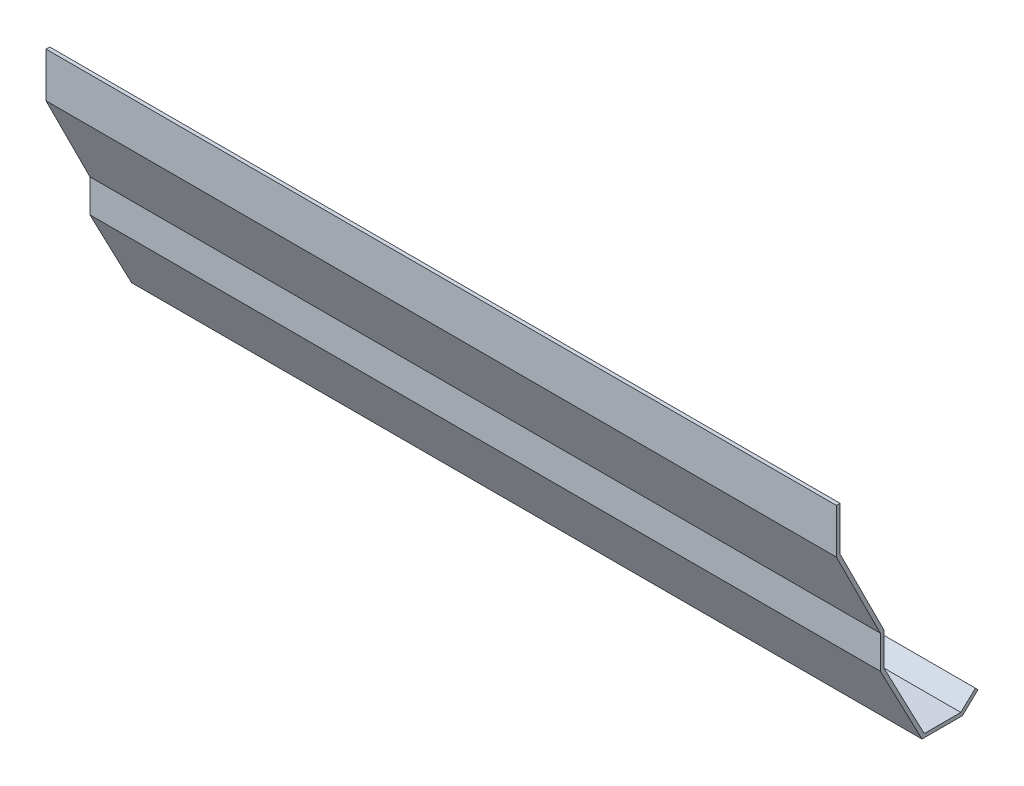
ISO-10303-21;
HEADER;
FILE_DESCRIPTION(('STEP AP214'),'2;1');
FILE_NAME('part.step','',(''),(''),'','','');
FILE_SCHEMA(('AUTOMOTIVE_DESIGN { 1 0 10303 214 1 1 1 1 }'));
ENDSEC;
DATA;
#1=APPLICATION_CONTEXT('core data for automotive mechanical design processes');
#2=APPLICATION_PROTOCOL_DEFINITION('international standard','automotive_design',2000,#1);
#3=PRODUCT_CONTEXT('',#1,'mechanical');
#4=PRODUCT('Part','Part','',(#3));
#5=PRODUCT_RELATED_PRODUCT_CATEGORY('part','',(#4));
#6=PRODUCT_DEFINITION_FORMATION('','',#4);
#7=PRODUCT_DEFINITION_CONTEXT('part definition',#1,'design');
#8=PRODUCT_DEFINITION('design','',#6,#7);
#9=PRODUCT_DEFINITION_SHAPE('','',#8);
#10=(LENGTH_UNIT() NAMED_UNIT(*) SI_UNIT(.MILLI.,.METRE.));
#11=(NAMED_UNIT(*) PLANE_ANGLE_UNIT() SI_UNIT($,.RADIAN.));
#12=(NAMED_UNIT(*) SI_UNIT($,.STERADIAN.) SOLID_ANGLE_UNIT());
#13=UNCERTAINTY_MEASURE_WITH_UNIT(LENGTH_MEASURE(1.E-05),#10,'distance_accuracy_value','');
#14=(GEOMETRIC_REPRESENTATION_CONTEXT(3) GLOBAL_UNCERTAINTY_ASSIGNED_CONTEXT((#13)) GLOBAL_UNIT_ASSIGNED_CONTEXT((#10,
#11,#12)) REPRESENTATION_CONTEXT('',''));
#15=CARTESIAN_POINT('',(0.,0.,0.));
#16=DIRECTION('',(0.,0.,1.));
#17=DIRECTION('',(1.,0.,0.));
#18=AXIS2_PLACEMENT_3D('',#15,#16,#17);
#19=CARTESIAN_POINT('',(685.8,0.,0.));
#20=DIRECTION('',(0.,-0.447213595499958,0.894427190999916));
#21=DIRECTION('',(0.,-0.894427190999916,-0.447213595499958));
#22=AXIS2_PLACEMENT_3D('',#19,#20,#21);
#23=PLANE('',#22);
#24=DIRECTION('',(0.,0.894427190999916,0.447213595499958));
#25=VECTOR('',#24,1.);
#26=CARTESIAN_POINT('',(0.,0.,0.));
#27=LINE('',#26,#25);
#28=CARTESIAN_POINT('',(0.,0.,0.));
#29=VERTEX_POINT('',#28);
#30=CARTESIAN_POINT('',(0.,76.2,38.1));
#31=VERTEX_POINT('',#30);
#32=EDGE_CURVE('E167',#29,#31,#27,.T.);
#33=ORIENTED_EDGE('',*,*,#32,.T.);
#34=DIRECTION('',(-1.,0.,0.));
#35=VECTOR('',#34,1.);
#36=CARTESIAN_POINT('',(685.8,76.2,38.1));
#37=LINE('',#36,#35);
#38=CARTESIAN_POINT('',(685.8,76.2,38.1));
#39=VERTEX_POINT('',#38);
#40=EDGE_CURVE('E11',#39,#31,#37,.T.);
#41=ORIENTED_EDGE('',*,*,#40,.F.);
#42=DIRECTION('',(0.,0.894427190999916,0.447213595499958));
#43=VECTOR('',#42,1.);
#44=CARTESIAN_POINT('',(685.8,0.,0.));
#45=LINE('',#44,#43);
#46=CARTESIAN_POINT('',(685.8,0.,0.));
#47=VERTEX_POINT('',#46);
#48=EDGE_CURVE('E193',#47,#39,#45,.T.);
#49=ORIENTED_EDGE('',*,*,#48,.F.);
#50=DIRECTION('',(-1.,0.,0.));
#51=VECTOR('',#50,1.);
#52=CARTESIAN_POINT('',(685.8,0.,0.));
#53=LINE('',#52,#51);
#54=EDGE_CURVE('E163',#47,#29,#53,.T.);
#55=ORIENTED_EDGE('',*,*,#54,.T.);
#56=EDGE_LOOP('',(#33,#41,#49,#55));
#57=FACE_BOUND('',#56,.T.);
#58=ADVANCED_FACE('F35',(#57),#23,.F.);
#59=CARTESIAN_POINT('',(685.8,76.2,38.1));
#60=DIRECTION('',(0.,0.,1.));
#61=DIRECTION('',(1.,0.,0.));
#62=AXIS2_PLACEMENT_3D('',#59,#60,#61);
#63=PLANE('',#62);
#64=DIRECTION('',(0.,1.,0.));
#65=VECTOR('',#64,1.);
#66=CARTESIAN_POINT('',(0.,76.2,38.1));
#67=LINE('',#66,#65);
#68=CARTESIAN_POINT('',(0.,114.3,38.1));
#69=VERTEX_POINT('',#68);
#70=EDGE_CURVE('E170',#31,#69,#67,.T.);
#71=ORIENTED_EDGE('',*,*,#70,.T.);
#72=DIRECTION('',(-1.,0.,0.));
#73=VECTOR('',#72,1.);
#74=CARTESIAN_POINT('',(685.8,114.3,38.1));
#75=LINE('',#74,#73);
#76=CARTESIAN_POINT('',(685.8,114.3,38.1));
#77=VERTEX_POINT('',#76);
#78=EDGE_CURVE('E43',#77,#69,#75,.T.);
#79=ORIENTED_EDGE('',*,*,#78,.F.);
#80=DIRECTION('',(0.,1.,0.));
#81=VECTOR('',#80,1.);
#82=CARTESIAN_POINT('',(685.8,76.2,38.1));
#83=LINE('',#82,#81);
#84=EDGE_CURVE('E112',#39,#77,#83,.T.);
#85=ORIENTED_EDGE('',*,*,#84,.F.);
#86=ORIENTED_EDGE('',*,*,#40,.T.);
#87=EDGE_LOOP('',(#71,#79,#85,#86));
#88=FACE_BOUND('',#87,.T.);
#89=ADVANCED_FACE('F281',(#88),#63,.F.);
#90=CARTESIAN_POINT('',(685.8,114.3,38.1));
#91=DIRECTION('',(0.,-1.,0.));
#92=DIRECTION('',(0.,0.,-1.));
#93=AXIS2_PLACEMENT_3D('',#90,#91,#92);
#94=PLANE('',#93);
#95=DIRECTION('',(0.,0.,1.));
#96=VECTOR('',#95,1.);
#97=CARTESIAN_POINT('',(0.,114.3,38.1));
#98=LINE('',#97,#96);
#99=CARTESIAN_POINT('',(0.,114.3,41.275));
#100=VERTEX_POINT('',#99);
#101=EDGE_CURVE('E172',#69,#100,#98,.T.);
#102=ORIENTED_EDGE('',*,*,#101,.T.);
#103=DIRECTION('',(-1.,0.,0.));
#104=VECTOR('',#103,1.);
#105=CARTESIAN_POINT('',(685.8,114.3,41.275));
#106=LINE('',#105,#104);
#107=CARTESIAN_POINT('',(685.8,114.3,41.275));
#108=VERTEX_POINT('',#107);
#109=EDGE_CURVE('E218',#108,#100,#106,.T.);
#110=ORIENTED_EDGE('',*,*,#109,.F.);
#111=DIRECTION('',(0.,0.,1.));
#112=VECTOR('',#111,1.);
#113=CARTESIAN_POINT('',(685.8,114.3,38.1));
#114=LINE('',#113,#112);
#115=EDGE_CURVE('E226',#77,#108,#114,.T.);
#116=ORIENTED_EDGE('',*,*,#115,.F.);
#117=ORIENTED_EDGE('',*,*,#78,.T.);
#118=EDGE_LOOP('',(#102,#110,#116,#117));
#119=FACE_BOUND('',#118,.T.);
#120=ADVANCED_FACE('F224',(#119),#94,.F.);
#121=CARTESIAN_POINT('',(685.8,114.3,41.275));
#122=DIRECTION('',(0.,0.,-1.));
#123=DIRECTION('',(-1.,0.,0.));
#124=AXIS2_PLACEMENT_3D('',#121,#122,#123);
#125=PLANE('',#124);
#126=DIRECTION('',(0.,-1.,0.));
#127=VECTOR('',#126,1.);
#128=CARTESIAN_POINT('',(0.,114.3,41.275));
#129=LINE('',#128,#127);
#130=CARTESIAN_POINT('',(0.,75.4504841714382,41.275));
#131=VERTEX_POINT('',#130);
#132=EDGE_CURVE('E174',#100,#131,#129,.T.);
#133=ORIENTED_EDGE('',*,*,#132,.T.);
#134=DIRECTION('',(-1.,0.,0.));
#135=VECTOR('',#134,1.);
#136=CARTESIAN_POINT('',(685.8,75.4504841714382,41.275));
#137=LINE('',#136,#135);
#138=CARTESIAN_POINT('',(685.8,75.4504841714382,41.275));
#139=VERTEX_POINT('',#138);
#140=EDGE_CURVE('E215',#139,#131,#137,.T.);
#141=ORIENTED_EDGE('',*,*,#140,.F.);
#142=DIRECTION('',(0.,-1.,0.));
#143=VECTOR('',#142,1.);
#144=CARTESIAN_POINT('',(685.8,114.3,41.275));
#145=LINE('',#144,#143);
#146=EDGE_CURVE('E244',#108,#139,#145,.T.);
#147=ORIENTED_EDGE('',*,*,#146,.F.);
#148=ORIENTED_EDGE('',*,*,#109,.T.);
#149=EDGE_LOOP('',(#133,#141,#147,#148));
#150=FACE_BOUND('',#149,.T.);
#151=ADVANCED_FACE('F235',(#150),#125,.F.);
#152=CARTESIAN_POINT('',(685.8,75.4504841714382,41.275));
#153=DIRECTION('',(0.,0.447213595499958,-0.894427190999916));
#154=DIRECTION('',(0.,0.894427190999916,0.447213595499958));
#155=AXIS2_PLACEMENT_3D('',#152,#153,#154);
#156=PLANE('',#155);
#157=DIRECTION('',(0.,-0.894427190999916,-0.447213595499958));
#158=VECTOR('',#157,1.);
#159=CARTESIAN_POINT('',(0.,75.4504841714382,41.275));
#160=LINE('',#159,#158);
#161=CARTESIAN_POINT('',(0.,-0.749515828561824,3.17499999999998));
#162=VERTEX_POINT('',#161);
#163=EDGE_CURVE('E176',#131,#162,#160,.T.);
#164=ORIENTED_EDGE('',*,*,#163,.T.);
#165=DIRECTION('',(-1.,0.,0.));
#166=VECTOR('',#165,1.);
#167=CARTESIAN_POINT('',(685.8,-0.749515828561824,3.17499999999998));
#168=LINE('',#167,#166);
#169=CARTESIAN_POINT('',(685.8,-0.749515828561824,3.17499999999998));
#170=VERTEX_POINT('',#169);
#171=EDGE_CURVE('E212',#170,#162,#168,.T.);
#172=ORIENTED_EDGE('',*,*,#171,.F.);
#173=DIRECTION('',(0.,-0.894427190999916,-0.447213595499958));
#174=VECTOR('',#173,1.);
#175=CARTESIAN_POINT('',(685.8,75.4504841714382,41.275));
#176=LINE('',#175,#174);
#177=EDGE_CURVE('E241',#139,#170,#176,.T.);
#178=ORIENTED_EDGE('',*,*,#177,.F.);
#179=ORIENTED_EDGE('',*,*,#140,.T.);
#180=EDGE_LOOP('',(#164,#172,#178,#179));
#181=FACE_BOUND('',#180,.T.);
#182=ADVANCED_FACE('F239',(#181),#156,.F.);
#183=CARTESIAN_POINT('',(685.8,-0.749515828561824,3.17499999999998));
#184=DIRECTION('',(0.,0.,-1.));
#185=DIRECTION('',(0.,1.,0.));
#186=AXIS2_PLACEMENT_3D('',#183,#184,#185);
#187=PLANE('',#186);
#188=DIRECTION('',(0.,-1.,0.));
#189=VECTOR('',#188,1.);
#190=CARTESIAN_POINT('',(0.,-0.749515828561824,3.17499999999998));
#191=LINE('',#190,#189);
#192=CARTESIAN_POINT('',(0.,-29.3562056276067,3.17499999999998));
#193=VERTEX_POINT('',#192);
#194=EDGE_CURVE('E178',#162,#193,#191,.T.);
#195=ORIENTED_EDGE('',*,*,#194,.T.);
#196=DIRECTION('',(-1.,0.,0.));
#197=VECTOR('',#196,1.);
#198=CARTESIAN_POINT('',(685.8,-29.3562056276067,3.17499999999998));
#199=LINE('',#198,#197);
#200=CARTESIAN_POINT('',(685.8,-29.3562056276067,3.17499999999998));
#201=VERTEX_POINT('',#200);
#202=EDGE_CURVE('E209',#201,#193,#199,.T.);
#203=ORIENTED_EDGE('',*,*,#202,.F.);
#204=DIRECTION('',(0.,-1.,0.));
#205=VECTOR('',#204,1.);
#206=CARTESIAN_POINT('',(685.8,-0.749515828561824,3.17499999999998));
#207=LINE('',#206,#205);
#208=EDGE_CURVE('E243',#170,#201,#207,.T.);
#209=ORIENTED_EDGE('',*,*,#208,.F.);
#210=ORIENTED_EDGE('',*,*,#171,.T.);
#211=EDGE_LOOP('',(#195,#203,#209,#210));
#212=FACE_BOUND('',#211,.T.);
#213=ADVANCED_FACE('F294',(#212),#187,.F.);
#214=CARTESIAN_POINT('',(685.8,-29.3562056276067,3.17499999999998));
#215=DIRECTION('',(0.,0.464006994670558,-0.885831535280155));
#216=DIRECTION('',(0.,0.885831535280155,0.464006994670558));
#217=AXIS2_PLACEMENT_3D('',#214,#215,#216);
#218=PLANE('',#217);
#219=DIRECTION('',(0.,-0.885831535280155,-0.464006994670558));
#220=VECTOR('',#219,1.);
#221=CARTESIAN_POINT('',(0.,-29.3562056276067,3.17499999999998));
#222=LINE('',#221,#220);
#223=CARTESIAN_POINT('',(0.,-98.425,-33.0038922903013));
#224=VERTEX_POINT('',#223);
#225=EDGE_CURVE('E180',#193,#224,#222,.T.);
#226=ORIENTED_EDGE('',*,*,#225,.T.);
#227=DIRECTION('',(-1.,0.,0.));
#228=VECTOR('',#227,1.);
#229=CARTESIAN_POINT('',(685.8,-98.425,-33.0038922903013));
#230=LINE('',#229,#228);
#231=CARTESIAN_POINT('',(685.8,-98.425,-33.0038922903013));
#232=VERTEX_POINT('',#231);
#233=EDGE_CURVE('E206',#232,#224,#230,.T.);
#234=ORIENTED_EDGE('',*,*,#233,.F.);
#235=DIRECTION('',(0.,-0.885831535280155,-0.464006994670558));
#236=VECTOR('',#235,1.);
#237=CARTESIAN_POINT('',(685.8,-29.3562056276067,3.17499999999998));
#238=LINE('',#237,#236);
#239=EDGE_CURVE('E246',#201,#232,#238,.T.);
#240=ORIENTED_EDGE('',*,*,#239,.F.);
#241=ORIENTED_EDGE('',*,*,#202,.T.);
#242=EDGE_LOOP('',(#226,#234,#240,#241));
#243=FACE_BOUND('',#242,.T.);
#244=ADVANCED_FACE('F297',(#243),#218,.F.);
#245=CARTESIAN_POINT('',(685.8,-98.425,-33.0038922903013));
#246=DIRECTION('',(0.,1.,0.));
#247=DIRECTION('',(0.,0.,1.));
#248=AXIS2_PLACEMENT_3D('',#245,#246,#247);
#249=PLANE('',#248);
#250=DIRECTION('',(0.,0.,-1.));
#251=VECTOR('',#250,1.);
#252=CARTESIAN_POINT('',(0.,-98.425,-33.0038922903013));
#253=LINE('',#252,#251);
#254=CARTESIAN_POINT('',(0.,-98.425,-68.0287240911878));
#255=VERTEX_POINT('',#254);
#256=EDGE_CURVE('E182',#224,#255,#253,.T.);
#257=ORIENTED_EDGE('',*,*,#256,.T.);
#258=DIRECTION('',(-1.,0.,0.));
#259=VECTOR('',#258,1.);
#260=CARTESIAN_POINT('',(685.8,-98.425,-68.0287240911878));
#261=LINE('',#260,#259);
#262=CARTESIAN_POINT('',(685.8,-98.425,-68.0287240911878));
#263=VERTEX_POINT('',#262);
#264=EDGE_CURVE('E203',#263,#255,#261,.T.);
#265=ORIENTED_EDGE('',*,*,#264,.F.);
#266=DIRECTION('',(0.,0.,-1.));
#267=VECTOR('',#266,1.);
#268=CARTESIAN_POINT('',(685.8,-98.425,-33.0038922903013));
#269=LINE('',#268,#267);
#270=EDGE_CURVE('E252',#232,#263,#269,.T.);
#271=ORIENTED_EDGE('',*,*,#270,.F.);
#272=ORIENTED_EDGE('',*,*,#233,.T.);
#273=EDGE_LOOP('',(#257,#265,#271,#272));
#274=FACE_BOUND('',#273,.T.);
#275=ADVANCED_FACE('F301',(#274),#249,.F.);
#276=CARTESIAN_POINT('',(685.8,-98.425,-68.0287240911878));
#277=DIRECTION('',(0.,0.729942991089569,0.683508031963937));
#278=DIRECTION('',(0.,-0.683508031963937,0.729942991089569));
#279=AXIS2_PLACEMENT_3D('',#276,#277,#278);
#280=PLANE('',#279);
#281=DIRECTION('',(0.,0.683508031963937,-0.729942991089569));
#282=VECTOR('',#281,1.);
#283=CARTESIAN_POINT('',(0.,-98.425,-68.0287240911878));
#284=LINE('',#283,#282);
#285=CARTESIAN_POINT('',(0.,-85.725,-81.5915142170055));
#286=VERTEX_POINT('',#285);
#287=EDGE_CURVE('E184',#255,#286,#284,.T.);
#288=ORIENTED_EDGE('',*,*,#287,.T.);
#289=DIRECTION('',(-1.,0.,0.));
#290=VECTOR('',#289,1.);
#291=CARTESIAN_POINT('',(685.8,-85.725,-81.5915142170055));
#292=LINE('',#291,#290);
#293=CARTESIAN_POINT('',(685.8,-85.725,-81.5915142170055));
#294=VERTEX_POINT('',#293);
#295=EDGE_CURVE('E200',#294,#286,#292,.T.);
#296=ORIENTED_EDGE('',*,*,#295,.F.);
#297=DIRECTION('',(0.,0.683508031963937,-0.729942991089569));
#298=VECTOR('',#297,1.);
#299=CARTESIAN_POINT('',(685.8,-98.425,-68.0287240911878));
#300=LINE('',#299,#298);
#301=EDGE_CURVE('E254',#263,#294,#300,.T.);
#302=ORIENTED_EDGE('',*,*,#301,.F.);
#303=ORIENTED_EDGE('',*,*,#264,.T.);
#304=EDGE_LOOP('',(#288,#296,#302,#303));
#305=FACE_BOUND('',#304,.T.);
#306=ADVANCED_FACE('F305',(#305),#280,.F.);
#307=CARTESIAN_POINT('',(685.8,-85.725,-81.5915142170055));
#308=DIRECTION('',(0.,-0.683508031963937,0.729942991089568));
#309=DIRECTION('',(0.,-0.729942991089568,-0.683508031963937));
#310=AXIS2_PLACEMENT_3D('',#307,#308,#309);
#311=PLANE('',#310);
#312=DIRECTION('',(0.,0.729942991089568,0.683508031963937));
#313=VECTOR('',#312,1.);
#314=CARTESIAN_POINT('',(0.,-85.725,-81.5915142170055));
#315=LINE('',#314,#313);
#316=CARTESIAN_POINT('',(0.,-83.357904162509,-79.375));
#317=VERTEX_POINT('',#316);
#318=EDGE_CURVE('E186',#286,#317,#315,.T.);
#319=ORIENTED_EDGE('',*,*,#318,.T.);
#320=DIRECTION('',(-1.,0.,0.));
#321=VECTOR('',#320,1.);
#322=CARTESIAN_POINT('',(685.8,-83.357904162509,-79.375));
#323=LINE('',#322,#321);
#324=CARTESIAN_POINT('',(685.8,-83.357904162509,-79.375));
#325=VERTEX_POINT('',#324);
#326=EDGE_CURVE('E197',#325,#317,#323,.T.);
#327=ORIENTED_EDGE('',*,*,#326,.F.);
#328=DIRECTION('',(0.,0.729942991089568,0.683508031963937));
#329=VECTOR('',#328,1.);
#330=CARTESIAN_POINT('',(685.8,-85.725,-81.5915142170055));
#331=LINE('',#330,#329);
#332=EDGE_CURVE('E256',#294,#325,#331,.T.);
#333=ORIENTED_EDGE('',*,*,#332,.F.);
#334=ORIENTED_EDGE('',*,*,#295,.T.);
#335=EDGE_LOOP('',(#319,#327,#333,#334));
#336=FACE_BOUND('',#335,.T.);
#337=ADVANCED_FACE('F262',(#336),#311,.F.);
#338=CARTESIAN_POINT('',(685.8,-83.357904162509,-79.375));
#339=DIRECTION('',(0.,-0.729942991089568,-0.683508031963937));
#340=DIRECTION('',(0.,0.683508031963937,-0.729942991089568));
#341=AXIS2_PLACEMENT_3D('',#338,#339,#340);
#342=PLANE('',#341);
#343=DIRECTION('',(0.,-0.683508031963937,0.729942991089568));
#344=VECTOR('',#343,1.);
#345=CARTESIAN_POINT('',(0.,-83.357904162509,-79.375));
#346=LINE('',#345,#344);
#347=CARTESIAN_POINT('',(0.,-95.25,-66.675));
#348=VERTEX_POINT('',#347);
#349=EDGE_CURVE('E188',#317,#348,#346,.T.);
#350=ORIENTED_EDGE('',*,*,#349,.T.);
#351=DIRECTION('',(-1.,0.,0.));
#352=VECTOR('',#351,1.);
#353=CARTESIAN_POINT('',(685.8,-95.25,-66.675));
#354=LINE('',#353,#352);
#355=CARTESIAN_POINT('',(685.8,-95.25,-66.675));
#356=VERTEX_POINT('',#355);
#357=EDGE_CURVE('E158',#356,#348,#354,.T.);
#358=ORIENTED_EDGE('',*,*,#357,.F.);
#359=DIRECTION('',(0.,-0.683508031963937,0.729942991089568));
#360=VECTOR('',#359,1.);
#361=CARTESIAN_POINT('',(685.8,-83.357904162509,-79.375));
#362=LINE('',#361,#360);
#363=EDGE_CURVE('E149',#325,#356,#362,.T.);
#364=ORIENTED_EDGE('',*,*,#363,.F.);
#365=ORIENTED_EDGE('',*,*,#326,.T.);
#366=EDGE_LOOP('',(#350,#358,#364,#365));
#367=FACE_BOUND('',#366,.T.);
#368=ADVANCED_FACE('F266',(#367),#342,.F.);
#369=CARTESIAN_POINT('',(685.8,-95.25,-66.675));
#370=DIRECTION('',(0.,-1.,0.));
#371=DIRECTION('',(0.,0.,-1.));
#372=AXIS2_PLACEMENT_3D('',#369,#370,#371);
#373=PLANE('',#372);
#374=DIRECTION('',(0.,0.,1.));
#375=VECTOR('',#374,1.);
#376=CARTESIAN_POINT('',(0.,-95.25,-66.675));
#377=LINE('',#376,#375);
#378=CARTESIAN_POINT('',(0.,-95.25,-34.925));
#379=VERTEX_POINT('',#378);
#380=EDGE_CURVE('E157',#348,#379,#377,.T.);
#381=ORIENTED_EDGE('',*,*,#380,.T.);
#382=DIRECTION('',(-1.,0.,0.));
#383=VECTOR('',#382,1.);
#384=CARTESIAN_POINT('',(685.8,-95.25,-34.925));
#385=LINE('',#384,#383);
#386=CARTESIAN_POINT('',(685.8,-95.25,-34.925));
#387=VERTEX_POINT('',#386);
#388=EDGE_CURVE('E154',#387,#379,#385,.T.);
#389=ORIENTED_EDGE('',*,*,#388,.F.);
#390=DIRECTION('',(0.,0.,1.));
#391=VECTOR('',#390,1.);
#392=CARTESIAN_POINT('',(685.8,-95.25,-66.675));
#393=LINE('',#392,#391);
#394=EDGE_CURVE('E143',#356,#387,#393,.T.);
#395=ORIENTED_EDGE('',*,*,#394,.F.);
#396=ORIENTED_EDGE('',*,*,#357,.T.);
#397=EDGE_LOOP('',(#381,#389,#395,#396));
#398=FACE_BOUND('',#397,.T.);
#399=ADVANCED_FACE('F155',(#398),#373,.F.);
#400=CARTESIAN_POINT('',(685.8,-95.25,-34.925));
#401=DIRECTION('',(0.,-0.464006994670558,0.885831535280155));
#402=DIRECTION('',(0.,-0.885831535280155,-0.464006994670558));
#403=AXIS2_PLACEMENT_3D('',#400,#401,#402);
#404=PLANE('',#403);
#405=DIRECTION('',(0.,0.885831535280155,0.464006994670558));
#406=VECTOR('',#405,1.);
#407=CARTESIAN_POINT('',(0.,-95.25,-34.925));
#408=LINE('',#407,#406);
#409=CARTESIAN_POINT('',(0.,-28.575,0.));
#410=VERTEX_POINT('',#409);
#411=EDGE_CURVE('E98',#379,#410,#408,.T.);
#412=ORIENTED_EDGE('',*,*,#411,.T.);
#413=DIRECTION('',(-1.,0.,0.));
#414=VECTOR('',#413,1.);
#415=CARTESIAN_POINT('',(685.8,-28.575,0.));
#416=LINE('',#415,#414);
#417=CARTESIAN_POINT('',(685.8,-28.575,0.));
#418=VERTEX_POINT('',#417);
#419=EDGE_CURVE('E159',#418,#410,#416,.T.);
#420=ORIENTED_EDGE('',*,*,#419,.F.);
#421=DIRECTION('',(0.,0.885831535280155,0.464006994670558));
#422=VECTOR('',#421,1.);
#423=CARTESIAN_POINT('',(685.8,-95.25,-34.925));
#424=LINE('',#423,#422);
#425=EDGE_CURVE('E147',#387,#418,#424,.T.);
#426=ORIENTED_EDGE('',*,*,#425,.F.);
#427=ORIENTED_EDGE('',*,*,#388,.T.);
#428=EDGE_LOOP('',(#412,#420,#426,#427));
#429=FACE_BOUND('',#428,.T.);
#430=ADVANCED_FACE('F161',(#429),#404,.F.);
#431=CARTESIAN_POINT('',(685.8,-28.575,0.));
#432=DIRECTION('',(0.,0.,1.));
#433=DIRECTION('',(1.,0.,0.));
#434=AXIS2_PLACEMENT_3D('',#431,#432,#433);
#435=PLANE('',#434);
#436=DIRECTION('',(0.,1.,0.));
#437=VECTOR('',#436,1.);
#438=CARTESIAN_POINT('',(0.,-28.575,0.));
#439=LINE('',#438,#437);
#440=EDGE_CURVE('E104',#410,#29,#439,.T.);
#441=ORIENTED_EDGE('',*,*,#440,.T.);
#442=ORIENTED_EDGE('',*,*,#54,.F.);
#443=DIRECTION('',(0.,1.,0.));
#444=VECTOR('',#443,1.);
#445=CARTESIAN_POINT('',(685.8,-28.575,0.));
#446=LINE('',#445,#444);
#447=EDGE_CURVE('E51',#418,#47,#446,.T.);
#448=ORIENTED_EDGE('',*,*,#447,.F.);
#449=ORIENTED_EDGE('',*,*,#419,.T.);
#450=EDGE_LOOP('',(#441,#442,#448,#449));
#451=FACE_BOUND('',#450,.T.);
#452=ADVANCED_FACE('F270',(#451),#435,.F.);
#453=CARTESIAN_POINT('',(685.8,0.,0.));
#454=DIRECTION('',(-1.,0.,0.));
#455=DIRECTION('',(0.,0.,1.));
#456=AXIS2_PLACEMENT_3D('',#453,#454,#455);
#457=PLANE('',#456);
#458=ORIENTED_EDGE('',*,*,#48,.T.);
#459=ORIENTED_EDGE('',*,*,#84,.T.);
#460=ORIENTED_EDGE('',*,*,#115,.T.);
#461=ORIENTED_EDGE('',*,*,#146,.T.);
#462=ORIENTED_EDGE('',*,*,#177,.T.);
#463=ORIENTED_EDGE('',*,*,#208,.T.);
#464=ORIENTED_EDGE('',*,*,#239,.T.);
#465=ORIENTED_EDGE('',*,*,#270,.T.);
#466=ORIENTED_EDGE('',*,*,#301,.T.);
#467=ORIENTED_EDGE('',*,*,#332,.T.);
#468=ORIENTED_EDGE('',*,*,#363,.T.);
#469=ORIENTED_EDGE('',*,*,#394,.T.);
#470=ORIENTED_EDGE('',*,*,#425,.T.);
#471=ORIENTED_EDGE('',*,*,#447,.T.);
#472=EDGE_LOOP('',(#458,#459,#460,#461,#462,#463,#464,#465,#466,#467,#468,#469,#470,#471));
#473=FACE_BOUND('',#472,.T.);
#474=ADVANCED_FACE('F145',(#473),#457,.F.);
#475=CARTESIAN_POINT('',(0.,0.,0.));
#476=DIRECTION('',(-1.,0.,0.));
#477=DIRECTION('',(0.,0.,1.));
#478=AXIS2_PLACEMENT_3D('',#475,#476,#477);
#479=PLANE('',#478);
#480=ORIENTED_EDGE('',*,*,#32,.F.);
#481=ORIENTED_EDGE('',*,*,#440,.F.);
#482=ORIENTED_EDGE('',*,*,#411,.F.);
#483=ORIENTED_EDGE('',*,*,#380,.F.);
#484=ORIENTED_EDGE('',*,*,#349,.F.);
#485=ORIENTED_EDGE('',*,*,#318,.F.);
#486=ORIENTED_EDGE('',*,*,#287,.F.);
#487=ORIENTED_EDGE('',*,*,#256,.F.);
#488=ORIENTED_EDGE('',*,*,#225,.F.);
#489=ORIENTED_EDGE('',*,*,#194,.F.);
#490=ORIENTED_EDGE('',*,*,#163,.F.);
#491=ORIENTED_EDGE('',*,*,#132,.F.);
#492=ORIENTED_EDGE('',*,*,#101,.F.);
#493=ORIENTED_EDGE('',*,*,#70,.F.);
#494=EDGE_LOOP('',(#480,#481,#482,#483,#484,#485,#486,#487,#488,#489,#490,#491,#492,#493));
#495=FACE_BOUND('',#494,.T.);
#496=ADVANCED_FACE('F230',(#495),#479,.T.);
#497=CLOSED_SHELL('',(#58,#89,#120,#151,#182,#213,#244,#275,#306,#337,#368,#399,#430,#452,#474,#496));
#498=MANIFOLD_SOLID_BREP('B2',#497);
#499=ADVANCED_BREP_SHAPE_REPRESENTATION('',(#18,#498),#14);
#500=SHAPE_DEFINITION_REPRESENTATION(#9,#499);
ENDSEC;
END-ISO-10303-21;
